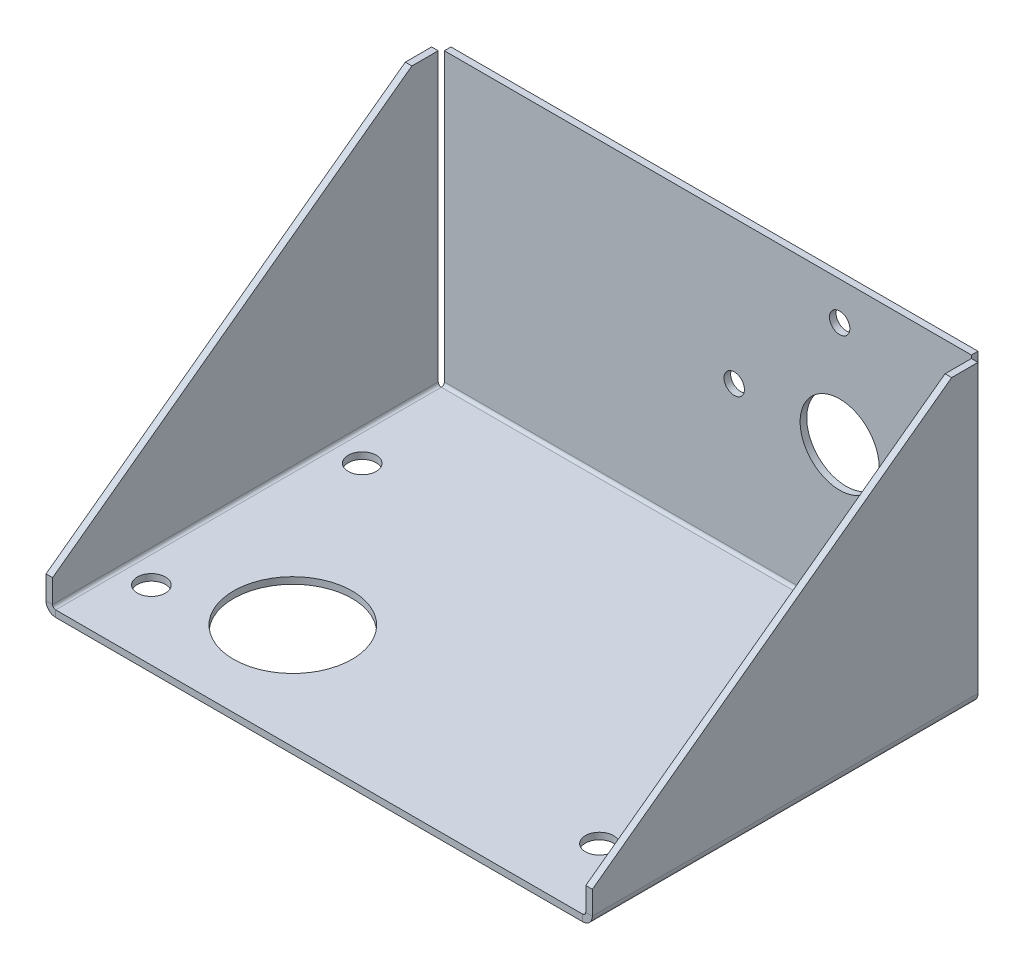
ISO-10303-21;
HEADER;
FILE_DESCRIPTION(('STEP AP214'),'2;1');
FILE_NAME('part.step','',(''),(''),'','','');
FILE_SCHEMA(('AUTOMOTIVE_DESIGN { 1 0 10303 214 1 1 1 1 }'));
ENDSEC;
DATA;
#1=APPLICATION_CONTEXT('core data for automotive mechanical design processes');
#2=APPLICATION_PROTOCOL_DEFINITION('international standard','automotive_design',2000,#1);
#3=PRODUCT_CONTEXT('',#1,'mechanical');
#4=PRODUCT('Part','Part','',(#3));
#5=PRODUCT_RELATED_PRODUCT_CATEGORY('part','',(#4));
#6=PRODUCT_DEFINITION_FORMATION('','',#4);
#7=PRODUCT_DEFINITION_CONTEXT('part definition',#1,'design');
#8=PRODUCT_DEFINITION('design','',#6,#7);
#9=PRODUCT_DEFINITION_SHAPE('','',#8);
#10=(LENGTH_UNIT() NAMED_UNIT(*) SI_UNIT(.MILLI.,.METRE.));
#11=(NAMED_UNIT(*) PLANE_ANGLE_UNIT() SI_UNIT($,.RADIAN.));
#12=(NAMED_UNIT(*) SI_UNIT($,.STERADIAN.) SOLID_ANGLE_UNIT());
#13=UNCERTAINTY_MEASURE_WITH_UNIT(LENGTH_MEASURE(1.E-05),#10,'distance_accuracy_value','');
#14=(GEOMETRIC_REPRESENTATION_CONTEXT(3) GLOBAL_UNCERTAINTY_ASSIGNED_CONTEXT((#13)) GLOBAL_UNIT_ASSIGNED_CONTEXT((#10,
#11,#12)) REPRESENTATION_CONTEXT('',''));
#15=CARTESIAN_POINT('',(0.,0.,0.));
#16=DIRECTION('',(0.,0.,1.));
#17=DIRECTION('',(1.,0.,0.));
#18=AXIS2_PLACEMENT_3D('',#15,#16,#17);
#19=CARTESIAN_POINT('',(127.,0.7366,-93.6625));
#20=DIRECTION('',(1.,0.,0.));
#21=DIRECTION('',(0.,0.,-1.));
#22=AXIS2_PLACEMENT_3D('',#19,#20,#21);
#23=PLANE('',#22);
#24=DIRECTION('',(0.,0.,-1.));
#25=VECTOR('',#24,1.);
#26=CARTESIAN_POINT('',(127.,0.7366,-93.6625));
#27=LINE('',#26,#25);
#28=CARTESIAN_POINT('',(127.,0.7366,-93.6625));
#29=VERTEX_POINT('',#28);
#30=CARTESIAN_POINT('',(127.,0.7366,-95.25));
#31=VERTEX_POINT('',#30);
#32=EDGE_CURVE('E13',#29,#31,#27,.T.);
#33=ORIENTED_EDGE('',*,*,#32,.F.);
#34=CARTESIAN_POINT('',(127.,0.7366,-92.9259));
#35=DIRECTION('',(-1.,0.,0.));
#36=DIRECTION('',(0.,0.,1.));
#37=AXIS2_PLACEMENT_3D('',#34,#35,#36);
#38=CIRCLE('',#37,0.7366);
#39=CARTESIAN_POINT('',(127.,0.,-92.9258999999999));
#40=VERTEX_POINT('',#39);
#41=EDGE_CURVE('E216',#40,#29,#38,.F.);
#42=ORIENTED_EDGE('',*,*,#41,.F.);
#43=DIRECTION('',(0.,1.,0.));
#44=VECTOR('',#43,1.);
#45=CARTESIAN_POINT('',(127.,-1.5875,-92.9258999999998));
#46=LINE('',#45,#44);
#47=CARTESIAN_POINT('',(127.,-1.58749999999997,-92.9258999999999));
#48=VERTEX_POINT('',#47);
#49=EDGE_CURVE('E103',#48,#40,#46,.T.);
#50=ORIENTED_EDGE('',*,*,#49,.F.);
#51=CARTESIAN_POINT('',(127.,0.7366,-92.9259));
#52=DIRECTION('',(1.,0.,0.));
#53=DIRECTION('',(0.,0.,-1.));
#54=AXIS2_PLACEMENT_3D('',#51,#52,#53);
#55=CIRCLE('',#54,2.3241);
#56=EDGE_CURVE('E325',#48,#31,#55,.T.);
#57=ORIENTED_EDGE('',*,*,#56,.T.);
#58=EDGE_LOOP('',(#33,#42,#50,#57));
#59=FACE_BOUND('',#58,.T.);
#60=ADVANCED_FACE('F94',(#59),#23,.T.);
#61=CARTESIAN_POINT('',(127.,-1.5875,-92.9258999999998));
#62=DIRECTION('',(1.,0.,0.));
#63=DIRECTION('',(0.,0.,-1.));
#64=AXIS2_PLACEMENT_3D('',#61,#62,#63);
#65=PLANE('',#64);
#66=DIRECTION('',(0.,1.,0.));
#67=VECTOR('',#66,1.);
#68=CARTESIAN_POINT('',(127.,0.,-93.6625));
#69=LINE('',#68,#67);
#70=CARTESIAN_POINT('',(127.,69.85,-93.6625));
#71=VERTEX_POINT('',#70);
#72=EDGE_CURVE('E315',#29,#71,#69,.T.);
#73=ORIENTED_EDGE('',*,*,#72,.F.);
#74=ORIENTED_EDGE('',*,*,#32,.T.);
#75=DIRECTION('',(0.,1.,0.));
#76=VECTOR('',#75,1.);
#77=CARTESIAN_POINT('',(127.,0.,-95.25));
#78=LINE('',#77,#76);
#79=CARTESIAN_POINT('',(127.,69.85,-95.25));
#80=VERTEX_POINT('',#79);
#81=EDGE_CURVE('E156',#31,#80,#78,.T.);
#82=ORIENTED_EDGE('',*,*,#81,.T.);
#83=DIRECTION('',(0.,0.,-1.));
#84=VECTOR('',#83,1.);
#85=CARTESIAN_POINT('',(127.,69.85,-93.6625));
#86=LINE('',#85,#84);
#87=EDGE_CURVE('E311',#71,#80,#86,.T.);
#88=ORIENTED_EDGE('',*,*,#87,.F.);
#89=EDGE_LOOP('',(#73,#74,#82,#88));
#90=FACE_BOUND('',#89,.T.);
#91=ADVANCED_FACE('F428',(#90),#65,.T.);
#92=CARTESIAN_POINT('',(0.,0.,-92.9258999999999));
#93=DIRECTION('',(-1.,0.,0.));
#94=DIRECTION('',(0.,0.,1.));
#95=AXIS2_PLACEMENT_3D('',#92,#93,#94);
#96=PLANE('',#95);
#97=DIRECTION('',(0.,-1.,0.));
#98=VECTOR('',#97,1.);
#99=CARTESIAN_POINT('',(0.,0.,-92.9258999999999));
#100=LINE('',#99,#98);
#101=CARTESIAN_POINT('',(0.,0.,-92.9258999999999));
#102=VERTEX_POINT('',#101);
#103=CARTESIAN_POINT('',(0.,-1.5875,-92.9258999999998));
#104=VERTEX_POINT('',#103);
#105=EDGE_CURVE('E378',#102,#104,#100,.T.);
#106=ORIENTED_EDGE('',*,*,#105,.F.);
#107=CARTESIAN_POINT('',(0.,0.7366,-92.9259));
#108=DIRECTION('',(-1.,0.,0.));
#109=DIRECTION('',(0.,0.,1.));
#110=AXIS2_PLACEMENT_3D('',#107,#108,#109);
#111=CIRCLE('',#110,0.7366);
#112=CARTESIAN_POINT('',(0.,0.7366,-93.6625));
#113=VERTEX_POINT('',#112);
#114=EDGE_CURVE('E340',#102,#113,#111,.F.);
#115=ORIENTED_EDGE('',*,*,#114,.T.);
#116=DIRECTION('',(0.,0.,1.));
#117=VECTOR('',#116,1.);
#118=CARTESIAN_POINT('',(0.,0.7366,-95.25));
#119=LINE('',#118,#117);
#120=CARTESIAN_POINT('',(0.,0.7366,-95.25));
#121=VERTEX_POINT('',#120);
#122=EDGE_CURVE('E150',#121,#113,#119,.T.);
#123=ORIENTED_EDGE('',*,*,#122,.F.);
#124=CARTESIAN_POINT('',(0.,0.7366,-92.9259));
#125=DIRECTION('',(1.,0.,0.));
#126=DIRECTION('',(0.,0.,-1.));
#127=AXIS2_PLACEMENT_3D('',#124,#125,#126);
#128=CIRCLE('',#127,2.3241);
#129=EDGE_CURVE('E312',#104,#121,#128,.T.);
#130=ORIENTED_EDGE('',*,*,#129,.F.);
#131=EDGE_LOOP('',(#106,#115,#123,#130));
#132=FACE_BOUND('',#131,.T.);
#133=ADVANCED_FACE('F407',(#132),#96,.T.);
#134=CARTESIAN_POINT('',(127.,0.,-95.25));
#135=DIRECTION('',(0.,0.,1.));
#136=DIRECTION('',(1.,0.,0.));
#137=AXIS2_PLACEMENT_3D('',#134,#135,#136);
#138=PLANE('',#137);
#139=CARTESIAN_POINT('',(95.25,60.6933,-95.25));
#140=DIRECTION('',(0.,0.,1.));
#141=DIRECTION('',(1.,0.,0.));
#142=AXIS2_PLACEMENT_3D('',#139,#140,#141);
#143=CIRCLE('',#142,2.45745);
#144=CARTESIAN_POINT('',(97.70745,60.6933,-95.25));
#145=VERTEX_POINT('',#144);
#146=EDGE_CURVE('E618',#145,#145,#143,.T.);
#147=ORIENTED_EDGE('',*,*,#146,.T.);
#148=EDGE_LOOP('',(#147));
#149=FACE_BOUND('',#148,.T.);
#150=CARTESIAN_POINT('',(120.65,35.2933,-95.25));
#151=DIRECTION('',(0.,0.,1.));
#152=DIRECTION('',(1.,0.,0.));
#153=AXIS2_PLACEMENT_3D('',#150,#151,#152);
#154=CIRCLE('',#153,2.45745);
#155=CARTESIAN_POINT('',(123.10745,35.2933,-95.25));
#156=VERTEX_POINT('',#155);
#157=EDGE_CURVE('E626',#156,#156,#154,.T.);
#158=ORIENTED_EDGE('',*,*,#157,.T.);
#159=EDGE_LOOP('',(#158));
#160=FACE_BOUND('',#159,.T.);
#161=CARTESIAN_POINT('',(95.25,9.8933,-95.25));
#162=DIRECTION('',(0.,0.,1.));
#163=DIRECTION('',(1.,0.,0.));
#164=AXIS2_PLACEMENT_3D('',#161,#162,#163);
#165=CIRCLE('',#164,2.45745);
#166=CARTESIAN_POINT('',(97.70745,9.8933,-95.25));
#167=VERTEX_POINT('',#166);
#168=EDGE_CURVE('E634',#167,#167,#165,.T.);
#169=ORIENTED_EDGE('',*,*,#168,.T.);
#170=EDGE_LOOP('',(#169));
#171=FACE_BOUND('',#170,.T.);
#172=CARTESIAN_POINT('',(69.85,35.2933,-95.25));
#173=DIRECTION('',(0.,0.,1.));
#174=DIRECTION('',(1.,0.,0.));
#175=AXIS2_PLACEMENT_3D('',#172,#173,#174);
#176=CIRCLE('',#175,2.45745);
#177=CARTESIAN_POINT('',(72.30745,35.2933,-95.25));
#178=VERTEX_POINT('',#177);
#179=EDGE_CURVE('E642',#178,#178,#176,.T.);
#180=ORIENTED_EDGE('',*,*,#179,.T.);
#181=EDGE_LOOP('',(#180));
#182=FACE_BOUND('',#181,.T.);
#183=CARTESIAN_POINT('',(95.25,35.2933,-95.25));
#184=DIRECTION('',(0.,0.,1.));
#185=DIRECTION('',(1.,0.,0.));
#186=AXIS2_PLACEMENT_3D('',#183,#184,#185);
#187=CIRCLE('',#186,9.52499999999999);
#188=CARTESIAN_POINT('',(104.775,35.2933,-95.25));
#189=VERTEX_POINT('',#188);
#190=EDGE_CURVE('E647',#189,#189,#187,.T.);
#191=ORIENTED_EDGE('',*,*,#190,.T.);
#192=EDGE_LOOP('',(#191));
#193=FACE_BOUND('',#192,.T.);
#194=DIRECTION('',(0.,1.,0.));
#195=VECTOR('',#194,1.);
#196=CARTESIAN_POINT('',(0.,0.,-95.25));
#197=LINE('',#196,#195);
#198=CARTESIAN_POINT('',(0.,69.85,-95.25));
#199=VERTEX_POINT('',#198);
#200=EDGE_CURVE('E297',#121,#199,#197,.T.);
#201=ORIENTED_EDGE('',*,*,#200,.T.);
#202=DIRECTION('',(-1.,0.,0.));
#203=VECTOR('',#202,1.);
#204=CARTESIAN_POINT('',(127.,69.85,-95.25));
#205=LINE('',#204,#203);
#206=EDGE_CURVE('E373',#80,#199,#205,.T.);
#207=ORIENTED_EDGE('',*,*,#206,.F.);
#208=ORIENTED_EDGE('',*,*,#81,.F.);
#209=DIRECTION('',(-1.,0.,0.));
#210=VECTOR('',#209,1.);
#211=CARTESIAN_POINT('',(127.,0.7366,-95.25));
#212=LINE('',#211,#210);
#213=EDGE_CURVE('E328',#31,#121,#212,.T.);
#214=ORIENTED_EDGE('',*,*,#213,.T.);
#215=EDGE_LOOP('',(#201,#207,#208,#214));
#216=FACE_BOUND('',#215,.T.);
#217=ADVANCED_FACE('F425',(#149,#160,#171,#182,#193,#216),#138,.F.);
#218=CARTESIAN_POINT('',(127.,69.85,-93.6625));
#219=DIRECTION('',(0.,1.,0.));
#220=DIRECTION('',(0.,0.,1.));
#221=AXIS2_PLACEMENT_3D('',#218,#219,#220);
#222=PLANE('',#221);
#223=DIRECTION('',(0.,0.,-1.));
#224=VECTOR('',#223,1.);
#225=CARTESIAN_POINT('',(0.,69.85,-93.6625));
#226=LINE('',#225,#224);
#227=CARTESIAN_POINT('',(0.,69.85,-93.6625));
#228=VERTEX_POINT('',#227);
#229=EDGE_CURVE('E332',#228,#199,#226,.T.);
#230=ORIENTED_EDGE('',*,*,#229,.F.);
#231=DIRECTION('',(-1.,0.,0.));
#232=VECTOR('',#231,1.);
#233=CARTESIAN_POINT('',(127.,69.85,-93.6625));
#234=LINE('',#233,#232);
#235=EDGE_CURVE('E370',#71,#228,#234,.T.);
#236=ORIENTED_EDGE('',*,*,#235,.F.);
#237=ORIENTED_EDGE('',*,*,#87,.T.);
#238=ORIENTED_EDGE('',*,*,#206,.T.);
#239=EDGE_LOOP('',(#230,#236,#237,#238));
#240=FACE_BOUND('',#239,.T.);
#241=ADVANCED_FACE('F427',(#240),#222,.T.);
#242=CARTESIAN_POINT('',(127.,0.,-93.6625));
#243=DIRECTION('',(0.,0.,1.));
#244=DIRECTION('',(1.,0.,0.));
#245=AXIS2_PLACEMENT_3D('',#242,#243,#244);
#246=PLANE('',#245);
#247=CARTESIAN_POINT('',(95.25,60.6933,-93.6625));
#248=DIRECTION('',(0.,0.,1.));
#249=DIRECTION('',(1.,0.,0.));
#250=AXIS2_PLACEMENT_3D('',#247,#248,#249);
#251=CIRCLE('',#250,2.45744999999999);
#252=CARTESIAN_POINT('',(97.70745,60.6933,-93.6625));
#253=VERTEX_POINT('',#252);
#254=EDGE_CURVE('E611',#253,#253,#251,.T.);
#255=ORIENTED_EDGE('',*,*,#254,.F.);
#256=EDGE_LOOP('',(#255));
#257=FACE_BOUND('',#256,.T.);
#258=CARTESIAN_POINT('',(120.65,35.2933,-93.6625));
#259=DIRECTION('',(0.,0.,1.));
#260=DIRECTION('',(1.,0.,0.));
#261=AXIS2_PLACEMENT_3D('',#258,#259,#260);
#262=CIRCLE('',#261,2.45744999999999);
#263=CARTESIAN_POINT('',(123.10745,35.2933,-93.6625));
#264=VERTEX_POINT('',#263);
#265=EDGE_CURVE('E622',#264,#264,#262,.T.);
#266=ORIENTED_EDGE('',*,*,#265,.F.);
#267=EDGE_LOOP('',(#266));
#268=FACE_BOUND('',#267,.T.);
#269=CARTESIAN_POINT('',(95.25,9.8933,-93.6625));
#270=DIRECTION('',(0.,0.,1.));
#271=DIRECTION('',(1.,0.,0.));
#272=AXIS2_PLACEMENT_3D('',#269,#270,#271);
#273=CIRCLE('',#272,2.45744999999999);
#274=CARTESIAN_POINT('',(97.70745,9.8933,-93.6625));
#275=VERTEX_POINT('',#274);
#276=EDGE_CURVE('E630',#275,#275,#273,.T.);
#277=ORIENTED_EDGE('',*,*,#276,.F.);
#278=EDGE_LOOP('',(#277));
#279=FACE_BOUND('',#278,.T.);
#280=CARTESIAN_POINT('',(69.85,35.2933,-93.6625));
#281=DIRECTION('',(0.,0.,1.));
#282=DIRECTION('',(1.,0.,0.));
#283=AXIS2_PLACEMENT_3D('',#280,#281,#282);
#284=CIRCLE('',#283,2.45744999999999);
#285=CARTESIAN_POINT('',(72.30745,35.2933,-93.6625));
#286=VERTEX_POINT('',#285);
#287=EDGE_CURVE('E638',#286,#286,#284,.T.);
#288=ORIENTED_EDGE('',*,*,#287,.F.);
#289=EDGE_LOOP('',(#288));
#290=FACE_BOUND('',#289,.T.);
#291=CARTESIAN_POINT('',(95.25,35.2933,-93.6625));
#292=DIRECTION('',(0.,0.,1.));
#293=DIRECTION('',(1.,0.,0.));
#294=AXIS2_PLACEMENT_3D('',#291,#292,#293);
#295=CIRCLE('',#294,9.52499999999999);
#296=CARTESIAN_POINT('',(104.775,35.2933,-93.6625));
#297=VERTEX_POINT('',#296);
#298=EDGE_CURVE('E646',#297,#297,#295,.T.);
#299=ORIENTED_EDGE('',*,*,#298,.F.);
#300=EDGE_LOOP('',(#299));
#301=FACE_BOUND('',#300,.T.);
#302=DIRECTION('',(0.,1.,0.));
#303=VECTOR('',#302,1.);
#304=CARTESIAN_POINT('',(0.,0.,-93.6625));
#305=LINE('',#304,#303);
#306=EDGE_CURVE('E336',#113,#228,#305,.T.);
#307=ORIENTED_EDGE('',*,*,#306,.F.);
#308=DIRECTION('',(-1.,0.,0.));
#309=VECTOR('',#308,1.);
#310=CARTESIAN_POINT('',(127.,0.7366,-93.6625));
#311=LINE('',#310,#309);
#312=EDGE_CURVE('E366',#29,#113,#311,.T.);
#313=ORIENTED_EDGE('',*,*,#312,.F.);
#314=ORIENTED_EDGE('',*,*,#72,.T.);
#315=ORIENTED_EDGE('',*,*,#235,.T.);
#316=EDGE_LOOP('',(#307,#313,#314,#315));
#317=FACE_BOUND('',#316,.T.);
#318=ADVANCED_FACE('F419',(#257,#268,#279,#290,#301,#317),#246,.T.);
#319=CARTESIAN_POINT('',(127.,0.7366,-92.9259));
#320=DIRECTION('',(-1.,0.,0.));
#321=DIRECTION('',(0.,0.,1.));
#322=AXIS2_PLACEMENT_3D('',#319,#320,#321);
#323=CYLINDRICAL_SURFACE('',#322,0.7366);
#324=ORIENTED_EDGE('',*,*,#114,.F.);
#325=DIRECTION('',(-1.,0.,0.));
#326=VECTOR('',#325,1.);
#327=CARTESIAN_POINT('',(127.,0.,-92.9258999999999));
#328=LINE('',#327,#326);
#329=EDGE_CURVE('E190',#40,#102,#328,.T.);
#330=ORIENTED_EDGE('',*,*,#329,.F.);
#331=ORIENTED_EDGE('',*,*,#41,.T.);
#332=ORIENTED_EDGE('',*,*,#312,.T.);
#333=EDGE_LOOP('',(#324,#330,#331,#332));
#334=FACE_BOUND('',#333,.T.);
#335=ADVANCED_FACE('F415',(#334),#323,.F.);
#336=CARTESIAN_POINT('',(127.,0.,0.));
#337=DIRECTION('',(0.,1.,0.));
#338=DIRECTION('',(0.,0.,1.));
#339=AXIS2_PLACEMENT_3D('',#336,#337,#338);
#340=PLANE('',#339);
#341=CARTESIAN_POINT('',(6.34999999999999,0.,-16.7258999999999));
#342=DIRECTION('',(0.,1.,0.));
#343=DIRECTION('',(0.,0.,1.));
#344=AXIS2_PLACEMENT_3D('',#341,#342,#343);
#345=CIRCLE('',#344,3.3782);
#346=CARTESIAN_POINT('',(6.34999999999999,0.,-13.3476999999999));
#347=VERTEX_POINT('',#346);
#348=EDGE_CURVE('E588',#347,#347,#345,.T.);
#349=ORIENTED_EDGE('',*,*,#348,.F.);
#350=EDGE_LOOP('',(#349));
#351=FACE_BOUND('',#350,.T.);
#352=CARTESIAN_POINT('',(114.3,0.,-67.5258999999999));
#353=DIRECTION('',(0.,1.,0.));
#354=DIRECTION('',(0.,0.,1.));
#355=AXIS2_PLACEMENT_3D('',#352,#353,#354);
#356=CIRCLE('',#355,3.37819999999999);
#357=CARTESIAN_POINT('',(114.3,0.,-64.1476999999999));
#358=VERTEX_POINT('',#357);
#359=EDGE_CURVE('E580',#358,#358,#356,.T.);
#360=ORIENTED_EDGE('',*,*,#359,.F.);
#361=EDGE_LOOP('',(#360));
#362=FACE_BOUND('',#361,.T.);
#363=CARTESIAN_POINT('',(114.3,0.,-16.7258999999999));
#364=DIRECTION('',(0.,1.,0.));
#365=DIRECTION('',(0.,0.,1.));
#366=AXIS2_PLACEMENT_3D('',#363,#364,#365);
#367=CIRCLE('',#366,3.37819999999999);
#368=CARTESIAN_POINT('',(114.3,0.,-13.3476999999999));
#369=VERTEX_POINT('',#368);
#370=EDGE_CURVE('E575',#369,#369,#367,.T.);
#371=ORIENTED_EDGE('',*,*,#370,.F.);
#372=EDGE_LOOP('',(#371));
#373=FACE_BOUND('',#372,.T.);
#374=CARTESIAN_POINT('',(6.34999999999999,0.,-67.5258999999999));
#375=DIRECTION('',(0.,1.,0.));
#376=DIRECTION('',(0.,0.,1.));
#377=AXIS2_PLACEMENT_3D('',#374,#375,#376);
#378=CIRCLE('',#377,3.37820000000001);
#379=CARTESIAN_POINT('',(6.34999999999999,0.,-64.1476999999999));
#380=VERTEX_POINT('',#379);
#381=EDGE_CURVE('E587',#380,#380,#378,.T.);
#382=ORIENTED_EDGE('',*,*,#381,.F.);
#383=EDGE_LOOP('',(#382));
#384=FACE_BOUND('',#383,.T.);
#385=CARTESIAN_POINT('',(31.75,0.,-25.4));
#386=DIRECTION('',(0.,1.,0.));
#387=DIRECTION('',(0.,0.,1.));
#388=AXIS2_PLACEMENT_3D('',#385,#386,#387);
#389=CIRCLE('',#388,14.2875);
#390=CARTESIAN_POINT('',(31.75,0.,-11.1125));
#391=VERTEX_POINT('',#390);
#392=EDGE_CURVE('E603',#391,#391,#389,.T.);
#393=ORIENTED_EDGE('',*,*,#392,.F.);
#394=EDGE_LOOP('',(#393));
#395=FACE_BOUND('',#394,.T.);
#396=DIRECTION('',(0.,0.,-1.));
#397=VECTOR('',#396,1.);
#398=CARTESIAN_POINT('',(0.,0.,0.));
#399=LINE('',#398,#397);
#400=CARTESIAN_POINT('',(0.,0.,0.));
#401=VERTEX_POINT('',#400);
#402=EDGE_CURVE('E186',#401,#102,#399,.T.);
#403=ORIENTED_EDGE('',*,*,#402,.F.);
#404=DIRECTION('',(-1.,0.,0.));
#405=VECTOR('',#404,1.);
#406=CARTESIAN_POINT('',(127.,0.,0.));
#407=LINE('',#406,#405);
#408=CARTESIAN_POINT('',(127.,0.,0.));
#409=VERTEX_POINT('',#408);
#410=EDGE_CURVE('E177',#409,#401,#407,.T.);
#411=ORIENTED_EDGE('',*,*,#410,.F.);
#412=DIRECTION('',(0.,0.,-1.));
#413=VECTOR('',#412,1.);
#414=CARTESIAN_POINT('',(127.,0.,0.));
#415=LINE('',#414,#413);
#416=EDGE_CURVE('E182',#409,#40,#415,.T.);
#417=ORIENTED_EDGE('',*,*,#416,.T.);
#418=ORIENTED_EDGE('',*,*,#329,.T.);
#419=EDGE_LOOP('',(#403,#411,#417,#418));
#420=FACE_BOUND('',#419,.T.);
#421=ADVANCED_FACE('F179',(#351,#362,#373,#384,#395,#420),#340,.T.);
#422=CARTESIAN_POINT('',(127.,-1.5875,0.));
#423=DIRECTION('',(0.,0.,1.));
#424=DIRECTION('',(1.,0.,0.));
#425=AXIS2_PLACEMENT_3D('',#422,#423,#424);
#426=PLANE('',#425);
#427=DIRECTION('',(0.,1.,0.));
#428=VECTOR('',#427,1.);
#429=CARTESIAN_POINT('',(0.,-1.5875,0.));
#430=LINE('',#429,#428);
#431=CARTESIAN_POINT('',(0.,-1.5875,0.));
#432=VERTEX_POINT('',#431);
#433=EDGE_CURVE('E345',#432,#401,#430,.T.);
#434=ORIENTED_EDGE('',*,*,#433,.F.);
#435=DIRECTION('',(-1.,0.,0.));
#436=VECTOR('',#435,1.);
#437=CARTESIAN_POINT('',(127.,-1.5875,0.));
#438=LINE('',#437,#436);
#439=CARTESIAN_POINT('',(127.,-1.5875,0.));
#440=VERTEX_POINT('',#439);
#441=EDGE_CURVE('E191',#440,#432,#438,.T.);
#442=ORIENTED_EDGE('',*,*,#441,.F.);
#443=DIRECTION('',(0.,1.,0.));
#444=VECTOR('',#443,1.);
#445=CARTESIAN_POINT('',(127.,-1.5875,0.));
#446=LINE('',#445,#444);
#447=EDGE_CURVE('E194',#440,#409,#446,.T.);
#448=ORIENTED_EDGE('',*,*,#447,.T.);
#449=ORIENTED_EDGE('',*,*,#410,.T.);
#450=EDGE_LOOP('',(#434,#442,#448,#449));
#451=FACE_BOUND('',#450,.T.);
#452=ADVANCED_FACE('F195',(#451),#426,.T.);
#453=CARTESIAN_POINT('',(127.,-1.5875,0.));
#454=DIRECTION('',(0.,1.,0.));
#455=DIRECTION('',(0.,0.,1.));
#456=AXIS2_PLACEMENT_3D('',#453,#454,#455);
#457=PLANE('',#456);
#458=CARTESIAN_POINT('',(6.34999999999999,-1.5875,-16.7258999999999));
#459=DIRECTION('',(0.,1.,0.));
#460=DIRECTION('',(0.,0.,1.));
#461=AXIS2_PLACEMENT_3D('',#458,#459,#460);
#462=CIRCLE('',#461,3.3782);
#463=CARTESIAN_POINT('',(6.34999999999999,-1.5875,-13.3476999999999));
#464=VERTEX_POINT('',#463);
#465=EDGE_CURVE('E583',#464,#464,#462,.T.);
#466=ORIENTED_EDGE('',*,*,#465,.T.);
#467=EDGE_LOOP('',(#466));
#468=FACE_BOUND('',#467,.T.);
#469=CARTESIAN_POINT('',(114.3,-1.5875,-67.5258999999999));
#470=DIRECTION('',(0.,1.,0.));
#471=DIRECTION('',(0.,0.,1.));
#472=AXIS2_PLACEMENT_3D('',#469,#470,#471);
#473=CIRCLE('',#472,3.37819999999999);
#474=CARTESIAN_POINT('',(114.3,-1.5875,-64.1476999999999));
#475=VERTEX_POINT('',#474);
#476=EDGE_CURVE('E592',#475,#475,#473,.T.);
#477=ORIENTED_EDGE('',*,*,#476,.T.);
#478=EDGE_LOOP('',(#477));
#479=FACE_BOUND('',#478,.T.);
#480=CARTESIAN_POINT('',(114.3,-1.5875,-16.7258999999999));
#481=DIRECTION('',(0.,1.,0.));
#482=DIRECTION('',(0.,0.,1.));
#483=AXIS2_PLACEMENT_3D('',#480,#481,#482);
#484=CIRCLE('',#483,3.37819999999999);
#485=CARTESIAN_POINT('',(114.3,-1.5875,-13.3476999999999));
#486=VERTEX_POINT('',#485);
#487=EDGE_CURVE('E572',#486,#486,#484,.T.);
#488=ORIENTED_EDGE('',*,*,#487,.T.);
#489=EDGE_LOOP('',(#488));
#490=FACE_BOUND('',#489,.T.);
#491=CARTESIAN_POINT('',(6.34999999999999,-1.5875,-67.5258999999999));
#492=DIRECTION('',(0.,1.,0.));
#493=DIRECTION('',(0.,0.,1.));
#494=AXIS2_PLACEMENT_3D('',#491,#492,#493);
#495=CIRCLE('',#494,3.37820000000001);
#496=CARTESIAN_POINT('',(6.34999999999999,-1.5875,-64.1476999999999));
#497=VERTEX_POINT('',#496);
#498=EDGE_CURVE('E599',#497,#497,#495,.T.);
#499=ORIENTED_EDGE('',*,*,#498,.T.);
#500=EDGE_LOOP('',(#499));
#501=FACE_BOUND('',#500,.T.);
#502=CARTESIAN_POINT('',(31.75,-1.5875,-25.4));
#503=DIRECTION('',(0.,1.,0.));
#504=DIRECTION('',(0.,0.,1.));
#505=AXIS2_PLACEMENT_3D('',#502,#503,#504);
#506=CIRCLE('',#505,14.2875);
#507=CARTESIAN_POINT('',(31.75,-1.5875,-11.1125));
#508=VERTEX_POINT('',#507);
#509=EDGE_CURVE('E607',#508,#508,#506,.T.);
#510=ORIENTED_EDGE('',*,*,#509,.T.);
#511=EDGE_LOOP('',(#510));
#512=FACE_BOUND('',#511,.T.);
#513=DIRECTION('',(0.,0.,-1.));
#514=VECTOR('',#513,1.);
#515=CARTESIAN_POINT('',(0.,-1.5875,0.));
#516=LINE('',#515,#514);
#517=EDGE_CURVE('E349',#432,#104,#516,.T.);
#518=ORIENTED_EDGE('',*,*,#517,.T.);
#519=DIRECTION('',(-1.,0.,0.));
#520=VECTOR('',#519,1.);
#521=CARTESIAN_POINT('',(127.,-1.5875,-92.9258999999998));
#522=LINE('',#521,#520);
#523=EDGE_CURVE('E358',#48,#104,#522,.T.);
#524=ORIENTED_EDGE('',*,*,#523,.F.);
#525=DIRECTION('',(0.,0.,-1.));
#526=VECTOR('',#525,1.);
#527=CARTESIAN_POINT('',(127.,-1.5875,0.));
#528=LINE('',#527,#526);
#529=EDGE_CURVE('E203',#440,#48,#528,.T.);
#530=ORIENTED_EDGE('',*,*,#529,.F.);
#531=ORIENTED_EDGE('',*,*,#441,.T.);
#532=EDGE_LOOP('',(#518,#524,#530,#531));
#533=FACE_BOUND('',#532,.T.);
#534=ADVANCED_FACE('F403',(#468,#479,#490,#501,#512,#533),#457,.F.);
#535=CARTESIAN_POINT('',(127.,0.7366,-92.9259));
#536=DIRECTION('',(-1.,0.,0.));
#537=DIRECTION('',(0.,0.,1.));
#538=AXIS2_PLACEMENT_3D('',#535,#536,#537);
#539=CYLINDRICAL_SURFACE('',#538,2.3241);
#540=ORIENTED_EDGE('',*,*,#129,.T.);
#541=ORIENTED_EDGE('',*,*,#213,.F.);
#542=ORIENTED_EDGE('',*,*,#56,.F.);
#543=ORIENTED_EDGE('',*,*,#523,.T.);
#544=EDGE_LOOP('',(#540,#541,#542,#543));
#545=FACE_BOUND('',#544,.T.);
#546=ADVANCED_FACE('F405',(#545),#539,.T.);
#547=CARTESIAN_POINT('',(0.,0.7366,-92.9259));
#548=DIRECTION('',(-1.,0.,0.));
#549=DIRECTION('',(0.,0.,1.));
#550=AXIS2_PLACEMENT_3D('',#547,#548,#549);
#551=PLANE('',#550);
#552=ORIENTED_EDGE('',*,*,#200,.F.);
#553=ORIENTED_EDGE('',*,*,#122,.T.);
#554=ORIENTED_EDGE('',*,*,#306,.T.);
#555=ORIENTED_EDGE('',*,*,#229,.T.);
#556=EDGE_LOOP('',(#552,#553,#554,#555));
#557=FACE_BOUND('',#556,.T.);
#558=ADVANCED_FACE('F423',(#557),#551,.T.);
#559=CARTESIAN_POINT('',(0.,0.7366,-92.9258999999999));
#560=DIRECTION('',(0.,0.,-1.));
#561=DIRECTION('',(-1.,0.,0.));
#562=AXIS2_PLACEMENT_3D('',#559,#560,#561);
#563=PLANE('',#562);
#564=DIRECTION('',(1.,0.,0.));
#565=VECTOR('',#564,1.);
#566=CARTESIAN_POINT('',(-2.3241,0.736600000000004,-92.9258999999999));
#567=LINE('',#566,#565);
#568=CARTESIAN_POINT('',(-0.7366,0.736599999999997,-92.9258999999999));
#569=VERTEX_POINT('',#568);
#570=CARTESIAN_POINT('',(-2.3241,0.736599999999992,-92.9258999999999));
#571=VERTEX_POINT('',#570);
#572=EDGE_CURVE('E291',#569,#571,#567,.F.);
#573=ORIENTED_EDGE('',*,*,#572,.F.);
#574=CARTESIAN_POINT('',(0.,0.7366,-92.9258999999999));
#575=DIRECTION('',(0.,0.,1.));
#576=DIRECTION('',(1.,0.,0.));
#577=AXIS2_PLACEMENT_3D('',#574,#575,#576);
#578=CIRCLE('',#577,0.736599999999997);
#579=EDGE_CURVE('E302',#102,#569,#578,.F.);
#580=ORIENTED_EDGE('',*,*,#579,.F.);
#581=ORIENTED_EDGE('',*,*,#105,.T.);
#582=CARTESIAN_POINT('',(0.,0.7366,-92.9258999999999));
#583=DIRECTION('',(0.,0.,1.));
#584=DIRECTION('',(1.,0.,0.));
#585=AXIS2_PLACEMENT_3D('',#582,#583,#584);
#586=CIRCLE('',#585,2.3241);
#587=EDGE_CURVE('E140',#104,#571,#586,.F.);
#588=ORIENTED_EDGE('',*,*,#587,.T.);
#589=EDGE_LOOP('',(#573,#580,#581,#588));
#590=FACE_BOUND('',#589,.T.);
#591=ADVANCED_FACE('F458',(#590),#563,.T.);
#592=CARTESIAN_POINT('',(0.,0.7366,0.));
#593=DIRECTION('',(0.,0.,-1.));
#594=DIRECTION('',(-1.,0.,0.));
#595=AXIS2_PLACEMENT_3D('',#592,#593,#594);
#596=PLANE('',#595);
#597=CARTESIAN_POINT('',(0.,0.7366,0.));
#598=DIRECTION('',(0.,0.,1.));
#599=DIRECTION('',(1.,0.,0.));
#600=AXIS2_PLACEMENT_3D('',#597,#598,#599);
#601=CIRCLE('',#600,0.736599999999997);
#602=CARTESIAN_POINT('',(-0.736599999999993,0.736599999999997,0.));
#603=VERTEX_POINT('',#602);
#604=EDGE_CURVE('E239',#603,#401,#601,.T.);
#605=ORIENTED_EDGE('',*,*,#604,.F.);
#606=DIRECTION('',(1.,0.,0.));
#607=VECTOR('',#606,1.);
#608=CARTESIAN_POINT('',(-0.7366,0.736599999999997,0.));
#609=LINE('',#608,#607);
#610=CARTESIAN_POINT('',(-2.3241,0.736599999999992,0.));
#611=VERTEX_POINT('',#610);
#612=EDGE_CURVE('E283',#603,#611,#609,.F.);
#613=ORIENTED_EDGE('',*,*,#612,.T.);
#614=CARTESIAN_POINT('',(0.,0.7366,0.));
#615=DIRECTION('',(0.,0.,1.));
#616=DIRECTION('',(1.,0.,0.));
#617=AXIS2_PLACEMENT_3D('',#614,#615,#616);
#618=CIRCLE('',#617,2.3241);
#619=EDGE_CURVE('E298',#611,#432,#618,.T.);
#620=ORIENTED_EDGE('',*,*,#619,.T.);
#621=ORIENTED_EDGE('',*,*,#433,.T.);
#622=EDGE_LOOP('',(#605,#613,#620,#621));
#623=FACE_BOUND('',#622,.T.);
#624=ADVANCED_FACE('F459',(#623),#596,.F.);
#625=CARTESIAN_POINT('',(0.,0.7366,0.));
#626=DIRECTION('',(0.,0.,1.));
#627=DIRECTION('',(-1.,0.,0.));
#628=AXIS2_PLACEMENT_3D('',#625,#626,#627);
#629=CYLINDRICAL_SURFACE('',#628,2.3241);
#630=ORIENTED_EDGE('',*,*,#517,.F.);
#631=ORIENTED_EDGE('',*,*,#619,.F.);
#632=DIRECTION('',(0.,0.,1.));
#633=VECTOR('',#632,1.);
#634=CARTESIAN_POINT('',(-2.3241,0.736599999999992,0.));
#635=LINE('',#634,#633);
#636=EDGE_CURVE('E279',#571,#611,#635,.T.);
#637=ORIENTED_EDGE('',*,*,#636,.F.);
#638=ORIENTED_EDGE('',*,*,#587,.F.);
#639=EDGE_LOOP('',(#630,#631,#637,#638));
#640=FACE_BOUND('',#639,.T.);
#641=ADVANCED_FACE('F462',(#640),#629,.T.);
#642=CARTESIAN_POINT('',(0.,0.7366,0.));
#643=DIRECTION('',(0.,0.,1.));
#644=DIRECTION('',(-1.,0.,0.));
#645=AXIS2_PLACEMENT_3D('',#642,#643,#644);
#646=CYLINDRICAL_SURFACE('',#645,0.736599999999997);
#647=ORIENTED_EDGE('',*,*,#402,.T.);
#648=ORIENTED_EDGE('',*,*,#579,.T.);
#649=DIRECTION('',(0.,0.,-1.));
#650=VECTOR('',#649,1.);
#651=CARTESIAN_POINT('',(-0.7366,0.736599999999997,-92.9258999999999));
#652=LINE('',#651,#650);
#653=EDGE_CURVE('E287',#569,#603,#652,.F.);
#654=ORIENTED_EDGE('',*,*,#653,.T.);
#655=ORIENTED_EDGE('',*,*,#604,.T.);
#656=EDGE_LOOP('',(#647,#648,#654,#655));
#657=FACE_BOUND('',#656,.T.);
#658=ADVANCED_FACE('F466',(#657),#646,.F.);
#659=CARTESIAN_POINT('',(-2.3241,0.,0.));
#660=DIRECTION('',(0.,0.,-1.));
#661=DIRECTION('',(-1.,0.,0.));
#662=AXIS2_PLACEMENT_3D('',#659,#660,#661);
#663=PLANE('',#662);
#664=ORIENTED_EDGE('',*,*,#612,.F.);
#665=DIRECTION('',(0.,1.,0.));
#666=VECTOR('',#665,1.);
#667=CARTESIAN_POINT('',(-0.736599999999997,0.,0.));
#668=LINE('',#667,#666);
#669=CARTESIAN_POINT('',(-0.73660000000002,6.34999999999999,0.));
#670=VERTEX_POINT('',#669);
#671=EDGE_CURVE('E275',#603,#670,#668,.T.);
#672=ORIENTED_EDGE('',*,*,#671,.T.);
#673=DIRECTION('',(1.,0.,0.));
#674=VECTOR('',#673,1.);
#675=CARTESIAN_POINT('',(-2.32410000000002,6.34999999999999,0.));
#676=LINE('',#675,#674);
#677=CARTESIAN_POINT('',(-2.32410000000002,6.34999999999999,0.));
#678=VERTEX_POINT('',#677);
#679=EDGE_CURVE('E236',#678,#670,#676,.T.);
#680=ORIENTED_EDGE('',*,*,#679,.F.);
#681=DIRECTION('',(0.,-1.,0.));
#682=VECTOR('',#681,1.);
#683=CARTESIAN_POINT('',(-2.3241,0.,0.));
#684=LINE('',#683,#682);
#685=EDGE_CURVE('E260',#611,#678,#684,.F.);
#686=ORIENTED_EDGE('',*,*,#685,.F.);
#687=EDGE_LOOP('',(#664,#672,#680,#686));
#688=FACE_BOUND('',#687,.T.);
#689=ADVANCED_FACE('F469',(#688),#663,.F.);
#690=CARTESIAN_POINT('',(-2.32410000000024,69.85,-92.9258999999999));
#691=DIRECTION('',(0.,0.,1.));
#692=DIRECTION('',(0.,-1.,0.));
#693=AXIS2_PLACEMENT_3D('',#690,#691,#692);
#694=PLANE('',#693);
#695=ORIENTED_EDGE('',*,*,#572,.T.);
#696=DIRECTION('',(0.,1.,0.));
#697=VECTOR('',#696,1.);
#698=CARTESIAN_POINT('',(-2.3241,0.,-92.9258999999999));
#699=LINE('',#698,#697);
#700=CARTESIAN_POINT('',(-2.32410000000024,69.85,-92.9258999999999));
#701=VERTEX_POINT('',#700);
#702=EDGE_CURVE('E248',#701,#571,#699,.F.);
#703=ORIENTED_EDGE('',*,*,#702,.F.);
#704=DIRECTION('',(1.,0.,0.));
#705=VECTOR('',#704,1.);
#706=CARTESIAN_POINT('',(-2.32410000000024,69.85,-92.9258999999999));
#707=LINE('',#706,#705);
#708=CARTESIAN_POINT('',(-0.736600000000241,69.85,-92.9258999999999));
#709=VERTEX_POINT('',#708);
#710=EDGE_CURVE('E244',#701,#709,#707,.T.);
#711=ORIENTED_EDGE('',*,*,#710,.T.);
#712=DIRECTION('',(0.,-1.,0.));
#713=VECTOR('',#712,1.);
#714=CARTESIAN_POINT('',(-0.736600000000241,69.85,-92.9258999999999));
#715=LINE('',#714,#713);
#716=EDGE_CURVE('E263',#709,#569,#715,.T.);
#717=ORIENTED_EDGE('',*,*,#716,.T.);
#718=EDGE_LOOP('',(#695,#703,#711,#717));
#719=FACE_BOUND('',#718,.T.);
#720=ADVANCED_FACE('F475',(#719),#694,.F.);
#721=CARTESIAN_POINT('',(-2.3241,0.,0.));
#722=DIRECTION('',(-1.,0.,0.));
#723=DIRECTION('',(0.,-1.,0.));
#724=AXIS2_PLACEMENT_3D('',#721,#722,#723);
#725=PLANE('',#724);
#726=ORIENTED_EDGE('',*,*,#702,.T.);
#727=ORIENTED_EDGE('',*,*,#636,.T.);
#728=ORIENTED_EDGE('',*,*,#685,.T.);
#729=DIRECTION('',(0.,-0.591430325718673,0.806356106084839));
#730=VECTOR('',#729,1.);
#731=CARTESIAN_POINT('',(-2.32410000000001,4.12883457835893,3.02833693586543));
#732=LINE('',#731,#730);
#733=CARTESIAN_POINT('',(-2.32410000000024,69.85,-86.5759));
#734=VERTEX_POINT('',#733);
#735=EDGE_CURVE('E256',#678,#734,#732,.F.);
#736=ORIENTED_EDGE('',*,*,#735,.T.);
#737=DIRECTION('',(0.,0.,1.));
#738=VECTOR('',#737,1.);
#739=CARTESIAN_POINT('',(-2.32410000000024,69.85,0.));
#740=LINE('',#739,#738);
#741=EDGE_CURVE('E252',#734,#701,#740,.F.);
#742=ORIENTED_EDGE('',*,*,#741,.T.);
#743=EDGE_LOOP('',(#726,#727,#728,#736,#742));
#744=FACE_BOUND('',#743,.T.);
#745=ADVANCED_FACE('F488',(#744),#725,.T.);
#746=CARTESIAN_POINT('',(-0.736599999999997,0.,0.));
#747=DIRECTION('',(-1.,0.,0.));
#748=DIRECTION('',(0.,-1.,0.));
#749=AXIS2_PLACEMENT_3D('',#746,#747,#748);
#750=PLANE('',#749);
#751=ORIENTED_EDGE('',*,*,#653,.F.);
#752=ORIENTED_EDGE('',*,*,#716,.F.);
#753=DIRECTION('',(0.,0.,-1.));
#754=VECTOR('',#753,1.);
#755=CARTESIAN_POINT('',(-0.736600000000241,69.85,-86.5758999999999));
#756=LINE('',#755,#754);
#757=CARTESIAN_POINT('',(-0.736600000000242,69.85,-86.5758999999999));
#758=VERTEX_POINT('',#757);
#759=EDGE_CURVE('E267',#758,#709,#756,.T.);
#760=ORIENTED_EDGE('',*,*,#759,.F.);
#761=DIRECTION('',(0.,0.591430325718673,-0.806356106084839));
#762=VECTOR('',#761,1.);
#763=CARTESIAN_POINT('',(-0.736600000000241,69.85,-86.5758999999999));
#764=LINE('',#763,#762);
#765=EDGE_CURVE('E271',#670,#758,#764,.T.);
#766=ORIENTED_EDGE('',*,*,#765,.F.);
#767=ORIENTED_EDGE('',*,*,#671,.F.);
#768=EDGE_LOOP('',(#751,#752,#760,#766,#767));
#769=FACE_BOUND('',#768,.T.);
#770=ADVANCED_FACE('F481',(#769),#750,.F.);
#771=CARTESIAN_POINT('',(-2.32410000000024,69.85,-86.5758999999999));
#772=DIRECTION('',(0.,-0.806356106084839,-0.591430325718673));
#773=DIRECTION('',(0.,0.591430325718673,-0.806356106084839));
#774=AXIS2_PLACEMENT_3D('',#771,#772,#773);
#775=PLANE('',#774);
#776=ORIENTED_EDGE('',*,*,#765,.T.);
#777=DIRECTION('',(1.,0.,0.));
#778=VECTOR('',#777,1.);
#779=CARTESIAN_POINT('',(-2.32410000000024,69.85,-86.5758999999999));
#780=LINE('',#779,#778);
#781=EDGE_CURVE('E240',#734,#758,#780,.T.);
#782=ORIENTED_EDGE('',*,*,#781,.F.);
#783=ORIENTED_EDGE('',*,*,#735,.F.);
#784=ORIENTED_EDGE('',*,*,#679,.T.);
#785=EDGE_LOOP('',(#776,#782,#783,#784));
#786=FACE_BOUND('',#785,.T.);
#787=ADVANCED_FACE('F477',(#786),#775,.F.);
#788=CARTESIAN_POINT('',(-2.32410000000024,69.85,-86.5758999999999));
#789=DIRECTION('',(0.,-1.,0.));
#790=DIRECTION('',(1.,0.,0.));
#791=AXIS2_PLACEMENT_3D('',#788,#789,#790);
#792=PLANE('',#791);
#793=ORIENTED_EDGE('',*,*,#759,.T.);
#794=ORIENTED_EDGE('',*,*,#710,.F.);
#795=ORIENTED_EDGE('',*,*,#741,.F.);
#796=ORIENTED_EDGE('',*,*,#781,.T.);
#797=EDGE_LOOP('',(#793,#794,#795,#796));
#798=FACE_BOUND('',#797,.T.);
#799=ADVANCED_FACE('F480',(#798),#792,.F.);
#800=CARTESIAN_POINT('',(127.,0.736600000000007,0.));
#801=DIRECTION('',(0.,0.,1.));
#802=DIRECTION('',(1.,0.,0.));
#803=AXIS2_PLACEMENT_3D('',#800,#801,#802);
#804=PLANE('',#803);
#805=DIRECTION('',(-1.,0.,0.));
#806=VECTOR('',#805,1.);
#807=CARTESIAN_POINT('',(129.3241,0.736599999999997,0.));
#808=LINE('',#807,#806);
#809=CARTESIAN_POINT('',(127.7366,0.736600000000004,0.));
#810=VERTEX_POINT('',#809);
#811=CARTESIAN_POINT('',(129.3241,0.736599999999997,0.));
#812=VERTEX_POINT('',#811);
#813=EDGE_CURVE('E221',#810,#812,#808,.F.);
#814=ORIENTED_EDGE('',*,*,#813,.F.);
#815=CARTESIAN_POINT('',(127.,0.736600000000007,0.));
#816=DIRECTION('',(0.,0.,-1.));
#817=DIRECTION('',(-1.,0.,0.));
#818=AXIS2_PLACEMENT_3D('',#815,#816,#817);
#819=CIRCLE('',#818,0.736599999999976);
#820=EDGE_CURVE('E211',#409,#810,#819,.F.);
#821=ORIENTED_EDGE('',*,*,#820,.F.);
#822=ORIENTED_EDGE('',*,*,#447,.F.);
#823=CARTESIAN_POINT('',(127.,0.736600000000007,0.));
#824=DIRECTION('',(0.,0.,-1.));
#825=DIRECTION('',(-1.,0.,0.));
#826=AXIS2_PLACEMENT_3D('',#823,#824,#825);
#827=CIRCLE('',#826,2.32409999999998);
#828=EDGE_CURVE('E229',#440,#812,#827,.F.);
#829=ORIENTED_EDGE('',*,*,#828,.T.);
#830=EDGE_LOOP('',(#814,#821,#822,#829));
#831=FACE_BOUND('',#830,.T.);
#832=ADVANCED_FACE('F219',(#831),#804,.T.);
#833=CARTESIAN_POINT('',(127.,0.736600000000007,-92.9258999999999));
#834=DIRECTION('',(0.,0.,1.));
#835=DIRECTION('',(1.,0.,0.));
#836=AXIS2_PLACEMENT_3D('',#833,#834,#835);
#837=PLANE('',#836);
#838=CARTESIAN_POINT('',(127.,0.736600000000007,-92.9258999999999));
#839=DIRECTION('',(0.,0.,-1.));
#840=DIRECTION('',(-1.,0.,0.));
#841=AXIS2_PLACEMENT_3D('',#838,#839,#840);
#842=CIRCLE('',#841,0.736599999999976);
#843=CARTESIAN_POINT('',(127.7366,0.736600000000004,-92.9258999999999));
#844=VERTEX_POINT('',#843);
#845=EDGE_CURVE('E214',#844,#40,#842,.T.);
#846=ORIENTED_EDGE('',*,*,#845,.F.);
#847=DIRECTION('',(-1.,0.,0.));
#848=VECTOR('',#847,1.);
#849=CARTESIAN_POINT('',(127.7366,0.736600000000004,-92.9258999999999));
#850=LINE('',#849,#848);
#851=CARTESIAN_POINT('',(129.3241,0.736599999999997,-92.9258999999999));
#852=VERTEX_POINT('',#851);
#853=EDGE_CURVE('E694',#844,#852,#850,.F.);
#854=ORIENTED_EDGE('',*,*,#853,.T.);
#855=CARTESIAN_POINT('',(127.,0.736600000000007,-92.9258999999999));
#856=DIRECTION('',(0.,0.,-1.));
#857=DIRECTION('',(-1.,0.,0.));
#858=AXIS2_PLACEMENT_3D('',#855,#856,#857);
#859=CIRCLE('',#858,2.32409999999998);
#860=EDGE_CURVE('E223',#852,#48,#859,.T.);
#861=ORIENTED_EDGE('',*,*,#860,.T.);
#862=ORIENTED_EDGE('',*,*,#49,.T.);
#863=EDGE_LOOP('',(#846,#854,#861,#862));
#864=FACE_BOUND('',#863,.T.);
#865=ADVANCED_FACE('F383',(#864),#837,.F.);
#866=CARTESIAN_POINT('',(127.,0.736600000000007,-92.9258999999999));
#867=DIRECTION('',(0.,0.,-1.));
#868=DIRECTION('',(1.,0.,0.));
#869=AXIS2_PLACEMENT_3D('',#866,#867,#868);
#870=CYLINDRICAL_SURFACE('',#869,2.32409999999998);
#871=ORIENTED_EDGE('',*,*,#529,.T.);
#872=ORIENTED_EDGE('',*,*,#860,.F.);
#873=DIRECTION('',(0.,0.,-1.));
#874=VECTOR('',#873,1.);
#875=CARTESIAN_POINT('',(129.3241,0.736599999999997,0.));
#876=LINE('',#875,#874);
#877=EDGE_CURVE('E691',#852,#812,#876,.F.);
#878=ORIENTED_EDGE('',*,*,#877,.T.);
#879=ORIENTED_EDGE('',*,*,#828,.F.);
#880=EDGE_LOOP('',(#871,#872,#878,#879));
#881=FACE_BOUND('',#880,.T.);
#882=ADVANCED_FACE('F398',(#881),#870,.T.);
#883=CARTESIAN_POINT('',(127.,0.736600000000007,-92.9258999999999));
#884=DIRECTION('',(0.,0.,-1.));
#885=DIRECTION('',(1.,0.,0.));
#886=AXIS2_PLACEMENT_3D('',#883,#884,#885);
#887=CYLINDRICAL_SURFACE('',#886,0.736599999999976);
#888=ORIENTED_EDGE('',*,*,#416,.F.);
#889=ORIENTED_EDGE('',*,*,#820,.T.);
#890=DIRECTION('',(0.,0.,-1.));
#891=VECTOR('',#890,1.);
#892=CARTESIAN_POINT('',(127.7366,0.736600000000004,0.));
#893=LINE('',#892,#891);
#894=EDGE_CURVE('E697',#810,#844,#893,.T.);
#895=ORIENTED_EDGE('',*,*,#894,.T.);
#896=ORIENTED_EDGE('',*,*,#845,.T.);
#897=EDGE_LOOP('',(#888,#889,#895,#896));
#898=FACE_BOUND('',#897,.T.);
#899=ADVANCED_FACE('F208',(#898),#887,.F.);
#900=CARTESIAN_POINT('',(129.3241,0.,0.));
#901=DIRECTION('',(0.,0.,-1.));
#902=DIRECTION('',(-1.,0.,0.));
#903=AXIS2_PLACEMENT_3D('',#900,#901,#902);
#904=PLANE('',#903);
#905=ORIENTED_EDGE('',*,*,#813,.T.);
#906=DIRECTION('',(0.,-1.,0.));
#907=VECTOR('',#906,1.);
#908=CARTESIAN_POINT('',(129.3241,-5.60654238937992E-13,0.));
#909=LINE('',#908,#907);
#910=CARTESIAN_POINT('',(129.3241,6.34999999999999,0.));
#911=VERTEX_POINT('',#910);
#912=EDGE_CURVE('E674',#911,#812,#909,.T.);
#913=ORIENTED_EDGE('',*,*,#912,.F.);
#914=DIRECTION('',(-1.,0.,0.));
#915=VECTOR('',#914,1.);
#916=CARTESIAN_POINT('',(129.3241,6.35,0.));
#917=LINE('',#916,#915);
#918=CARTESIAN_POINT('',(127.7366,6.35,0.));
#919=VERTEX_POINT('',#918);
#920=EDGE_CURVE('E659',#911,#919,#917,.T.);
#921=ORIENTED_EDGE('',*,*,#920,.T.);
#922=DIRECTION('',(0.,1.,0.));
#923=VECTOR('',#922,1.);
#924=CARTESIAN_POINT('',(127.7366,0.,0.));
#925=LINE('',#924,#923);
#926=EDGE_CURVE('E688',#919,#810,#925,.F.);
#927=ORIENTED_EDGE('',*,*,#926,.T.);
#928=EDGE_LOOP('',(#905,#913,#921,#927));
#929=FACE_BOUND('',#928,.T.);
#930=ADVANCED_FACE('F502',(#929),#904,.F.);
#931=CARTESIAN_POINT('',(129.3241,69.85,-92.9258999999999));
#932=DIRECTION('',(0.,0.,1.));
#933=DIRECTION('',(1.,0.,0.));
#934=AXIS2_PLACEMENT_3D('',#931,#932,#933);
#935=PLANE('',#934);
#936=ORIENTED_EDGE('',*,*,#853,.F.);
#937=DIRECTION('',(0.,-1.,0.));
#938=VECTOR('',#937,1.);
#939=CARTESIAN_POINT('',(127.7366,69.85,-92.9258999999999));
#940=LINE('',#939,#938);
#941=CARTESIAN_POINT('',(127.7366,69.85,-92.9258999999999));
#942=VERTEX_POINT('',#941);
#943=EDGE_CURVE('E684',#844,#942,#940,.F.);
#944=ORIENTED_EDGE('',*,*,#943,.T.);
#945=DIRECTION('',(-1.,0.,0.));
#946=VECTOR('',#945,1.);
#947=CARTESIAN_POINT('',(129.3241,69.85,-92.9258999999999));
#948=LINE('',#947,#946);
#949=CARTESIAN_POINT('',(129.3241,69.85,-92.9258999999999));
#950=VERTEX_POINT('',#949);
#951=EDGE_CURVE('E232',#950,#942,#948,.T.);
#952=ORIENTED_EDGE('',*,*,#951,.F.);
#953=DIRECTION('',(0.,1.,0.));
#954=VECTOR('',#953,1.);
#955=CARTESIAN_POINT('',(129.3241,-5.60654238937992E-13,-92.9258999999999));
#956=LINE('',#955,#954);
#957=EDGE_CURVE('E670',#852,#950,#956,.T.);
#958=ORIENTED_EDGE('',*,*,#957,.F.);
#959=EDGE_LOOP('',(#936,#944,#952,#958));
#960=FACE_BOUND('',#959,.T.);
#961=ADVANCED_FACE('F507',(#960),#935,.F.);
#962=CARTESIAN_POINT('',(129.3241,-5.60654238937992E-13,0.));
#963=DIRECTION('',(-1.,0.,0.));
#964=DIRECTION('',(0.,-1.,0.));
#965=AXIS2_PLACEMENT_3D('',#962,#963,#964);
#966=PLANE('',#965);
#967=ORIENTED_EDGE('',*,*,#877,.F.);
#968=ORIENTED_EDGE('',*,*,#957,.T.);
#969=DIRECTION('',(0.,0.,1.));
#970=VECTOR('',#969,1.);
#971=CARTESIAN_POINT('',(129.3241,69.85,0.));
#972=LINE('',#971,#970);
#973=CARTESIAN_POINT('',(129.3241,69.85,-86.5758999999999));
#974=VERTEX_POINT('',#973);
#975=EDGE_CURVE('E667',#950,#974,#972,.T.);
#976=ORIENTED_EDGE('',*,*,#975,.T.);
#977=DIRECTION('',(0.,-0.591430325718673,0.806356106084839));
#978=VECTOR('',#977,1.);
#979=CARTESIAN_POINT('',(129.3241,4.12883457835873,3.0283369358657));
#980=LINE('',#979,#978);
#981=EDGE_CURVE('E663',#974,#911,#980,.T.);
#982=ORIENTED_EDGE('',*,*,#981,.T.);
#983=ORIENTED_EDGE('',*,*,#912,.T.);
#984=EDGE_LOOP('',(#967,#968,#976,#982,#983));
#985=FACE_BOUND('',#984,.T.);
#986=ADVANCED_FACE('F511',(#985),#966,.F.);
#987=CARTESIAN_POINT('',(127.7366,-5.55111512312578E-13,0.));
#988=DIRECTION('',(-1.,0.,0.));
#989=DIRECTION('',(0.,-1.,0.));
#990=AXIS2_PLACEMENT_3D('',#987,#988,#989);
#991=PLANE('',#990);
#992=ORIENTED_EDGE('',*,*,#943,.F.);
#993=ORIENTED_EDGE('',*,*,#894,.F.);
#994=ORIENTED_EDGE('',*,*,#926,.F.);
#995=DIRECTION('',(0.,0.591430325718673,-0.806356106084839));
#996=VECTOR('',#995,1.);
#997=CARTESIAN_POINT('',(127.7366,69.85,-86.5758999999999));
#998=LINE('',#997,#996);
#999=CARTESIAN_POINT('',(127.7366,69.85,-86.5758999999999));
#1000=VERTEX_POINT('',#999);
#1001=EDGE_CURVE('E677',#1000,#919,#998,.F.);
#1002=ORIENTED_EDGE('',*,*,#1001,.F.);
#1003=DIRECTION('',(0.,0.,-1.));
#1004=VECTOR('',#1003,1.);
#1005=CARTESIAN_POINT('',(127.7366,69.85,-86.5758999999999));
#1006=LINE('',#1005,#1004);
#1007=EDGE_CURVE('E681',#942,#1000,#1006,.F.);
#1008=ORIENTED_EDGE('',*,*,#1007,.F.);
#1009=EDGE_LOOP('',(#992,#993,#994,#1002,#1008));
#1010=FACE_BOUND('',#1009,.T.);
#1011=ADVANCED_FACE('F517',(#1010),#991,.T.);
#1012=CARTESIAN_POINT('',(129.3241,69.85,-86.5758999999999));
#1013=DIRECTION('',(0.,-1.,0.));
#1014=DIRECTION('',(1.,0.,0.));
#1015=AXIS2_PLACEMENT_3D('',#1012,#1013,#1014);
#1016=PLANE('',#1015);
#1017=ORIENTED_EDGE('',*,*,#1007,.T.);
#1018=DIRECTION('',(-1.,0.,0.));
#1019=VECTOR('',#1018,1.);
#1020=CARTESIAN_POINT('',(129.3241,69.85,-86.5758999999999));
#1021=LINE('',#1020,#1019);
#1022=EDGE_CURVE('E656',#974,#1000,#1021,.T.);
#1023=ORIENTED_EDGE('',*,*,#1022,.F.);
#1024=ORIENTED_EDGE('',*,*,#975,.F.);
#1025=ORIENTED_EDGE('',*,*,#951,.T.);
#1026=EDGE_LOOP('',(#1017,#1023,#1024,#1025));
#1027=FACE_BOUND('',#1026,.T.);
#1028=ADVANCED_FACE('F513',(#1027),#1016,.F.);
#1029=CARTESIAN_POINT('',(129.3241,69.85,-86.5758999999999));
#1030=DIRECTION('',(0.,-0.806356106084839,-0.591430325718673));
#1031=DIRECTION('',(0.,0.591430325718673,-0.806356106084839));
#1032=AXIS2_PLACEMENT_3D('',#1029,#1030,#1031);
#1033=PLANE('',#1032);
#1034=ORIENTED_EDGE('',*,*,#1001,.T.);
#1035=ORIENTED_EDGE('',*,*,#920,.F.);
#1036=ORIENTED_EDGE('',*,*,#981,.F.);
#1037=ORIENTED_EDGE('',*,*,#1022,.T.);
#1038=EDGE_LOOP('',(#1034,#1035,#1036,#1037));
#1039=FACE_BOUND('',#1038,.T.);
#1040=ADVANCED_FACE('F516',(#1039),#1033,.F.);
#1041=CARTESIAN_POINT('',(95.25,35.2933,-95.25));
#1042=DIRECTION('',(0.,0.,1.));
#1043=DIRECTION('',(1.,0.,0.));
#1044=AXIS2_PLACEMENT_3D('',#1041,#1042,#1043);
#1045=CYLINDRICAL_SURFACE('',#1044,9.52499999999999);
#1046=ORIENTED_EDGE('',*,*,#190,.F.);
#1047=EDGE_LOOP('',(#1046));
#1048=FACE_BOUND('',#1047,.T.);
#1049=ORIENTED_EDGE('',*,*,#298,.T.);
#1050=EDGE_LOOP('',(#1049));
#1051=FACE_BOUND('',#1050,.T.);
#1052=ADVANCED_FACE('F521',(#1048,#1051),#1045,.F.);
#1053=CARTESIAN_POINT('',(69.85,35.2933,-93.6625));
#1054=DIRECTION('',(0.,0.,1.));
#1055=DIRECTION('',(1.,0.,0.));
#1056=AXIS2_PLACEMENT_3D('',#1053,#1054,#1055);
#1057=CYLINDRICAL_SURFACE('',#1056,2.45744999999999);
#1058=ORIENTED_EDGE('',*,*,#179,.F.);
#1059=EDGE_LOOP('',(#1058));
#1060=FACE_BOUND('',#1059,.T.);
#1061=ORIENTED_EDGE('',*,*,#287,.T.);
#1062=EDGE_LOOP('',(#1061));
#1063=FACE_BOUND('',#1062,.T.);
#1064=ADVANCED_FACE('F531',(#1060,#1063),#1057,.F.);
#1065=CARTESIAN_POINT('',(95.25,9.8933,-93.6625));
#1066=DIRECTION('',(0.,0.,1.));
#1067=DIRECTION('',(1.,0.,0.));
#1068=AXIS2_PLACEMENT_3D('',#1065,#1066,#1067);
#1069=CYLINDRICAL_SURFACE('',#1068,2.45744999999999);
#1070=ORIENTED_EDGE('',*,*,#168,.F.);
#1071=EDGE_LOOP('',(#1070));
#1072=FACE_BOUND('',#1071,.T.);
#1073=ORIENTED_EDGE('',*,*,#276,.T.);
#1074=EDGE_LOOP('',(#1073));
#1075=FACE_BOUND('',#1074,.T.);
#1076=ADVANCED_FACE('F535',(#1072,#1075),#1069,.F.);
#1077=CARTESIAN_POINT('',(120.65,35.2933,-93.6625));
#1078=DIRECTION('',(0.,0.,1.));
#1079=DIRECTION('',(1.,0.,0.));
#1080=AXIS2_PLACEMENT_3D('',#1077,#1078,#1079);
#1081=CYLINDRICAL_SURFACE('',#1080,2.45744999999999);
#1082=ORIENTED_EDGE('',*,*,#157,.F.);
#1083=EDGE_LOOP('',(#1082));
#1084=FACE_BOUND('',#1083,.T.);
#1085=ORIENTED_EDGE('',*,*,#265,.T.);
#1086=EDGE_LOOP('',(#1085));
#1087=FACE_BOUND('',#1086,.T.);
#1088=ADVANCED_FACE('F539',(#1084,#1087),#1081,.F.);
#1089=CARTESIAN_POINT('',(95.25,60.6933,-93.6625));
#1090=DIRECTION('',(0.,0.,1.));
#1091=DIRECTION('',(1.,0.,0.));
#1092=AXIS2_PLACEMENT_3D('',#1089,#1090,#1091);
#1093=CYLINDRICAL_SURFACE('',#1092,2.45744999999999);
#1094=ORIENTED_EDGE('',*,*,#146,.F.);
#1095=EDGE_LOOP('',(#1094));
#1096=FACE_BOUND('',#1095,.T.);
#1097=ORIENTED_EDGE('',*,*,#254,.T.);
#1098=EDGE_LOOP('',(#1097));
#1099=FACE_BOUND('',#1098,.T.);
#1100=ADVANCED_FACE('F543',(#1096,#1099),#1093,.F.);
#1101=CARTESIAN_POINT('',(31.75,-1.5875,-25.4));
#1102=DIRECTION('',(0.,1.,0.));
#1103=DIRECTION('',(0.,0.,1.));
#1104=AXIS2_PLACEMENT_3D('',#1101,#1102,#1103);
#1105=CYLINDRICAL_SURFACE('',#1104,14.2875);
#1106=ORIENTED_EDGE('',*,*,#509,.F.);
#1107=EDGE_LOOP('',(#1106));
#1108=FACE_BOUND('',#1107,.T.);
#1109=ORIENTED_EDGE('',*,*,#392,.T.);
#1110=EDGE_LOOP('',(#1109));
#1111=FACE_BOUND('',#1110,.T.);
#1112=ADVANCED_FACE('F547',(#1108,#1111),#1105,.F.);
#1113=CARTESIAN_POINT('',(6.34999999999999,-1.5875,-67.5258999999999));
#1114=DIRECTION('',(0.,1.,0.));
#1115=DIRECTION('',(0.,0.,1.));
#1116=AXIS2_PLACEMENT_3D('',#1113,#1114,#1115);
#1117=CYLINDRICAL_SURFACE('',#1116,3.37820000000001);
#1118=ORIENTED_EDGE('',*,*,#498,.F.);
#1119=EDGE_LOOP('',(#1118));
#1120=FACE_BOUND('',#1119,.T.);
#1121=ORIENTED_EDGE('',*,*,#381,.T.);
#1122=EDGE_LOOP('',(#1121));
#1123=FACE_BOUND('',#1122,.T.);
#1124=ADVANCED_FACE('F551',(#1120,#1123),#1117,.F.);
#1125=CARTESIAN_POINT('',(114.3,-1.5875,-16.7258999999999));
#1126=DIRECTION('',(0.,1.,0.));
#1127=DIRECTION('',(0.,0.,1.));
#1128=AXIS2_PLACEMENT_3D('',#1125,#1126,#1127);
#1129=CYLINDRICAL_SURFACE('',#1128,3.37819999999999);
#1130=ORIENTED_EDGE('',*,*,#487,.F.);
#1131=EDGE_LOOP('',(#1130));
#1132=FACE_BOUND('',#1131,.T.);
#1133=ORIENTED_EDGE('',*,*,#370,.T.);
#1134=EDGE_LOOP('',(#1133));
#1135=FACE_BOUND('',#1134,.T.);
#1136=ADVANCED_FACE('F555',(#1132,#1135),#1129,.F.);
#1137=CARTESIAN_POINT('',(114.3,-1.5875,-67.5258999999999));
#1138=DIRECTION('',(0.,1.,0.));
#1139=DIRECTION('',(0.,0.,1.));
#1140=AXIS2_PLACEMENT_3D('',#1137,#1138,#1139);
#1141=CYLINDRICAL_SURFACE('',#1140,3.37819999999999);
#1142=ORIENTED_EDGE('',*,*,#476,.F.);
#1143=EDGE_LOOP('',(#1142));
#1144=FACE_BOUND('',#1143,.T.);
#1145=ORIENTED_EDGE('',*,*,#359,.T.);
#1146=EDGE_LOOP('',(#1145));
#1147=FACE_BOUND('',#1146,.T.);
#1148=ADVANCED_FACE('F557',(#1144,#1147),#1141,.F.);
#1149=CARTESIAN_POINT('',(6.34999999999999,-1.5875,-16.7258999999999));
#1150=DIRECTION('',(0.,1.,0.));
#1151=DIRECTION('',(0.,0.,1.));
#1152=AXIS2_PLACEMENT_3D('',#1149,#1150,#1151);
#1153=CYLINDRICAL_SURFACE('',#1152,3.3782);
#1154=ORIENTED_EDGE('',*,*,#465,.F.);
#1155=EDGE_LOOP('',(#1154));
#1156=FACE_BOUND('',#1155,.T.);
#1157=ORIENTED_EDGE('',*,*,#348,.T.);
#1158=EDGE_LOOP('',(#1157));
#1159=FACE_BOUND('',#1158,.T.);
#1160=ADVANCED_FACE('F560',(#1156,#1159),#1153,.F.);
#1161=CLOSED_SHELL('',(#60,#91,#133,#217,#241,#318,#335,#421,#452,#534,#546,#558,#591,#624,#641,
#658,#689,#720,#745,#770,#787,#799,#832,#865,#882,#899,#930,#961,#986,#1011,#1028,#1040,#1052,
#1064,#1076,#1088,#1100,#1112,#1124,#1136,#1148,#1160));
#1162=MANIFOLD_SOLID_BREP('B2',#1161);
#1163=ADVANCED_BREP_SHAPE_REPRESENTATION('',(#18,#1162),#14);
#1164=SHAPE_DEFINITION_REPRESENTATION(#9,#1163);
ENDSEC;
END-ISO-10303-21;
